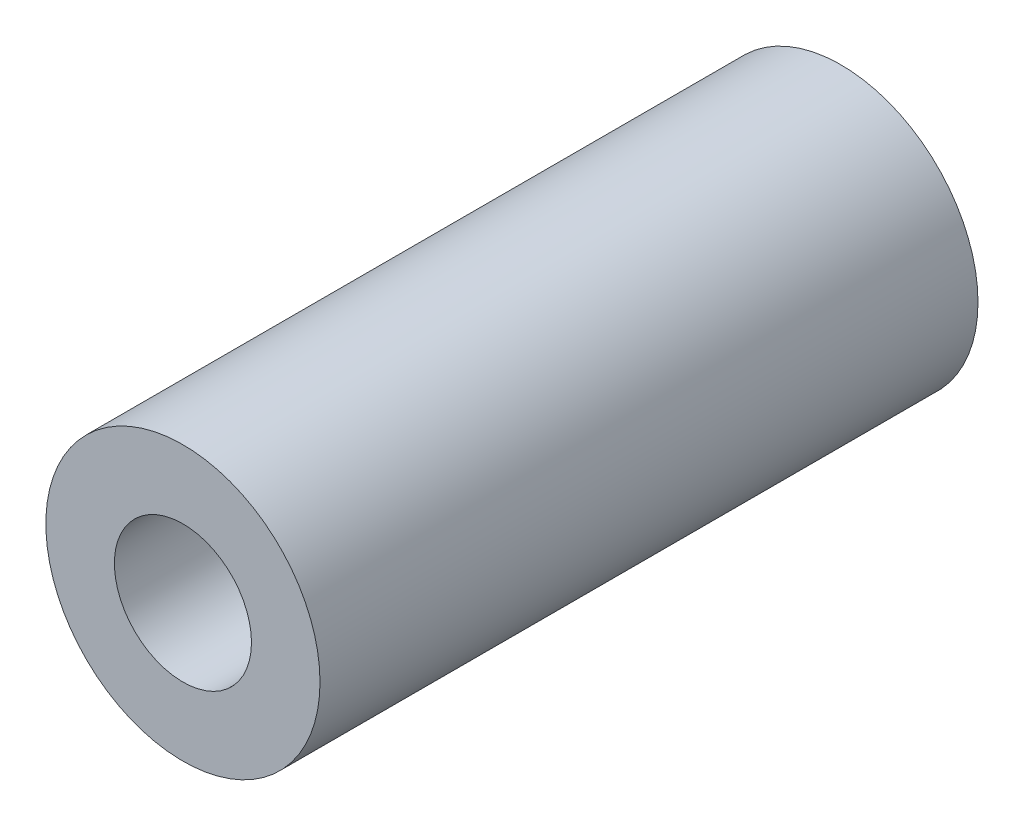
ISO-10303-21;
HEADER;
FILE_DESCRIPTION(('STEP AP214'),'2;1');
FILE_NAME('part.step','',(''),(''),'','','');
FILE_SCHEMA(('AUTOMOTIVE_DESIGN { 1 0 10303 214 1 1 1 1 }'));
ENDSEC;
DATA;
#1=APPLICATION_CONTEXT('core data for automotive mechanical design processes');
#2=APPLICATION_PROTOCOL_DEFINITION('international standard','automotive_design',2000,#1);
#3=PRODUCT_CONTEXT('',#1,'mechanical');
#4=PRODUCT('Part','Part','',(#3));
#5=PRODUCT_RELATED_PRODUCT_CATEGORY('part','',(#4));
#6=PRODUCT_DEFINITION_FORMATION('','',#4);
#7=PRODUCT_DEFINITION_CONTEXT('part definition',#1,'design');
#8=PRODUCT_DEFINITION('design','',#6,#7);
#9=PRODUCT_DEFINITION_SHAPE('','',#8);
#10=(LENGTH_UNIT() NAMED_UNIT(*) SI_UNIT(.MILLI.,.METRE.));
#11=(NAMED_UNIT(*) PLANE_ANGLE_UNIT() SI_UNIT($,.RADIAN.));
#12=(NAMED_UNIT(*) SI_UNIT($,.STERADIAN.) SOLID_ANGLE_UNIT());
#13=UNCERTAINTY_MEASURE_WITH_UNIT(LENGTH_MEASURE(1.E-05),#10,'distance_accuracy_value','');
#14=(GEOMETRIC_REPRESENTATION_CONTEXT(3) GLOBAL_UNCERTAINTY_ASSIGNED_CONTEXT((#13)) GLOBAL_UNIT_ASSIGNED_CONTEXT((#10,
#11,#12)) REPRESENTATION_CONTEXT('',''));
#15=CARTESIAN_POINT('',(0.,0.,0.));
#16=DIRECTION('',(0.,0.,1.));
#17=DIRECTION('',(1.,0.,0.));
#18=AXIS2_PLACEMENT_3D('',#15,#16,#17);
#19=CARTESIAN_POINT('',(0.,0.,12.));
#20=DIRECTION('',(0.,0.,-1.));
#21=DIRECTION('',(-1.,0.,0.));
#22=AXIS2_PLACEMENT_3D('',#19,#20,#21);
#23=CYLINDRICAL_SURFACE('',#22,2.5);
#24=CARTESIAN_POINT('',(0.,0.,12.));
#25=DIRECTION('',(0.,0.,1.));
#26=DIRECTION('',(1.,0.,0.));
#27=AXIS2_PLACEMENT_3D('',#24,#25,#26);
#28=CIRCLE('',#27,2.5);
#29=CARTESIAN_POINT('',(2.5,0.,12.));
#30=VERTEX_POINT('',#29);
#31=EDGE_CURVE('E10',#30,#30,#28,.T.);
#32=ORIENTED_EDGE('',*,*,#31,.F.);
#33=EDGE_LOOP('',(#32));
#34=FACE_BOUND('',#33,.T.);
#35=CARTESIAN_POINT('',(0.,0.,0.));
#36=DIRECTION('',(0.,0.,1.));
#37=DIRECTION('',(1.,0.,0.));
#38=AXIS2_PLACEMENT_3D('',#35,#36,#37);
#39=CIRCLE('',#38,2.5);
#40=CARTESIAN_POINT('',(2.5,0.,0.));
#41=VERTEX_POINT('',#40);
#42=EDGE_CURVE('E37',#41,#41,#39,.T.);
#43=ORIENTED_EDGE('',*,*,#42,.T.);
#44=EDGE_LOOP('',(#43));
#45=FACE_BOUND('',#44,.T.);
#46=ADVANCED_FACE('F34',(#34,#45),#23,.T.);
#47=CARTESIAN_POINT('',(0.,0.,12.));
#48=DIRECTION('',(0.,0.,1.));
#49=DIRECTION('',(1.,0.,0.));
#50=AXIS2_PLACEMENT_3D('',#47,#48,#49);
#51=PLANE('',#50);
#52=CARTESIAN_POINT('',(0.,0.,12.));
#53=DIRECTION('',(0.,0.,1.));
#54=DIRECTION('',(1.,0.,0.));
#55=AXIS2_PLACEMENT_3D('',#52,#53,#54);
#56=CIRCLE('',#55,1.25);
#57=CARTESIAN_POINT('',(1.25,0.,12.));
#58=VERTEX_POINT('',#57);
#59=EDGE_CURVE('E48',#58,#58,#56,.T.);
#60=ORIENTED_EDGE('',*,*,#59,.F.);
#61=EDGE_LOOP('',(#60));
#62=FACE_BOUND('',#61,.T.);
#63=ORIENTED_EDGE('',*,*,#31,.T.);
#64=EDGE_LOOP('',(#63));
#65=FACE_BOUND('',#64,.T.);
#66=ADVANCED_FACE('F54',(#62,#65),#51,.T.);
#67=CARTESIAN_POINT('',(0.,0.,0.));
#68=DIRECTION('',(0.,0.,1.));
#69=DIRECTION('',(1.,0.,0.));
#70=AXIS2_PLACEMENT_3D('',#67,#68,#69);
#71=PLANE('',#70);
#72=CARTESIAN_POINT('',(0.,0.,0.));
#73=DIRECTION('',(0.,0.,1.));
#74=DIRECTION('',(1.,0.,0.));
#75=AXIS2_PLACEMENT_3D('',#72,#73,#74);
#76=CIRCLE('',#75,1.25);
#77=CARTESIAN_POINT('',(1.25,0.,0.));
#78=VERTEX_POINT('',#77);
#79=EDGE_CURVE('E44',#78,#78,#76,.T.);
#80=ORIENTED_EDGE('',*,*,#79,.T.);
#81=EDGE_LOOP('',(#80));
#82=FACE_BOUND('',#81,.T.);
#83=ORIENTED_EDGE('',*,*,#42,.F.);
#84=EDGE_LOOP('',(#83));
#85=FACE_BOUND('',#84,.T.);
#86=ADVANCED_FACE('F56',(#82,#85),#71,.F.);
#87=CARTESIAN_POINT('',(0.,0.,12.));
#88=DIRECTION('',(0.,0.,1.));
#89=DIRECTION('',(1.,0.,0.));
#90=AXIS2_PLACEMENT_3D('',#87,#88,#89);
#91=CYLINDRICAL_SURFACE('',#90,1.25);
#92=ORIENTED_EDGE('',*,*,#79,.F.);
#93=EDGE_LOOP('',(#92));
#94=FACE_BOUND('',#93,.T.);
#95=ORIENTED_EDGE('',*,*,#59,.T.);
#96=EDGE_LOOP('',(#95));
#97=FACE_BOUND('',#96,.T.);
#98=ADVANCED_FACE('F52',(#94,#97),#91,.F.);
#99=CLOSED_SHELL('',(#46,#66,#86,#98));
#100=MANIFOLD_SOLID_BREP('B2',#99);
#101=ADVANCED_BREP_SHAPE_REPRESENTATION('',(#18,#100),#14);
#102=SHAPE_DEFINITION_REPRESENTATION(#9,#101);
ENDSEC;
END-ISO-10303-21;
